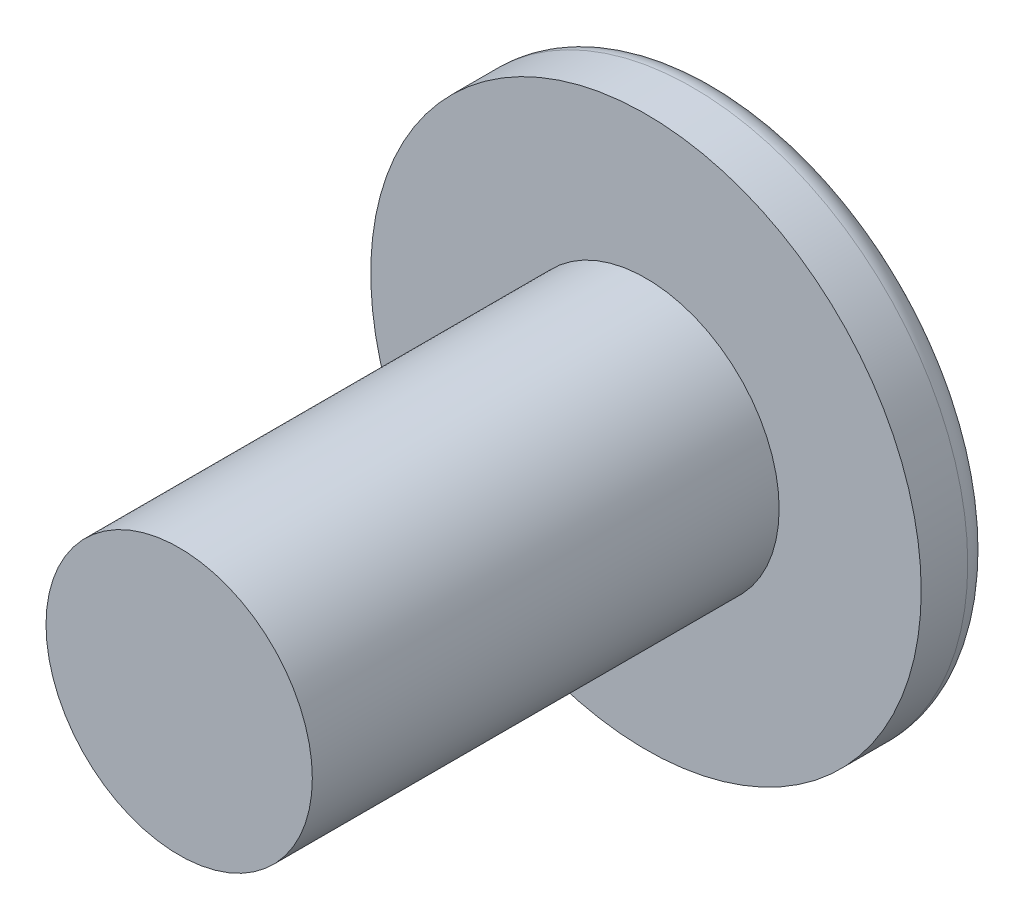
ISO-10303-21;
HEADER;
FILE_DESCRIPTION(('STEP AP214'),'2;1');
FILE_NAME('part.step','',(''),(''),'','','');
FILE_SCHEMA(('AUTOMOTIVE_DESIGN { 1 0 10303 214 1 1 1 1 }'));
ENDSEC;
DATA;
#1=APPLICATION_CONTEXT('core data for automotive mechanical design processes');
#2=APPLICATION_PROTOCOL_DEFINITION('international standard','automotive_design',2000,#1);
#3=PRODUCT_CONTEXT('',#1,'mechanical');
#4=PRODUCT('Part','Part','',(#3));
#5=PRODUCT_RELATED_PRODUCT_CATEGORY('part','',(#4));
#6=PRODUCT_DEFINITION_FORMATION('','',#4);
#7=PRODUCT_DEFINITION_CONTEXT('part definition',#1,'design');
#8=PRODUCT_DEFINITION('design','',#6,#7);
#9=PRODUCT_DEFINITION_SHAPE('','',#8);
#10=(LENGTH_UNIT() NAMED_UNIT(*) SI_UNIT(.MILLI.,.METRE.));
#11=(NAMED_UNIT(*) PLANE_ANGLE_UNIT() SI_UNIT($,.RADIAN.));
#12=(NAMED_UNIT(*) SI_UNIT($,.STERADIAN.) SOLID_ANGLE_UNIT());
#13=UNCERTAINTY_MEASURE_WITH_UNIT(LENGTH_MEASURE(1.E-05),#10,'distance_accuracy_value','');
#14=(GEOMETRIC_REPRESENTATION_CONTEXT(3) GLOBAL_UNCERTAINTY_ASSIGNED_CONTEXT((#13)) GLOBAL_UNIT_ASSIGNED_CONTEXT((#10,
#11,#12)) REPRESENTATION_CONTEXT('',''));
#15=CARTESIAN_POINT('',(0.,0.,0.));
#16=DIRECTION('',(0.,0.,1.));
#17=DIRECTION('',(1.,0.,0.));
#18=AXIS2_PLACEMENT_3D('',#15,#16,#17);
#19=CARTESIAN_POINT('',(0.,0.,1.44));
#20=DIRECTION('',(0.,0.,-1.));
#21=DIRECTION('',(-1.,0.,0.));
#22=AXIS2_PLACEMENT_3D('',#19,#20,#21);
#23=CYLINDRICAL_SURFACE('',#22,5.56);
#24=CARTESIAN_POINT('',(0.,0.,0.5));
#25=DIRECTION('',(0.,0.,1.));
#26=DIRECTION('',(1.,0.,0.));
#27=AXIS2_PLACEMENT_3D('',#24,#25,#26);
#28=CIRCLE('',#27,5.56);
#29=CARTESIAN_POINT('',(5.56,0.,0.5));
#30=VERTEX_POINT('',#29);
#31=EDGE_CURVE('E48',#30,#30,#28,.T.);
#32=ORIENTED_EDGE('',*,*,#31,.T.);
#33=EDGE_LOOP('',(#32));
#34=FACE_BOUND('',#33,.T.);
#35=CARTESIAN_POINT('',(0.,0.,1.44));
#36=DIRECTION('',(0.,0.,1.));
#37=DIRECTION('',(1.,0.,0.));
#38=AXIS2_PLACEMENT_3D('',#35,#36,#37);
#39=CIRCLE('',#38,5.56);
#40=CARTESIAN_POINT('',(5.56,0.,1.44));
#41=VERTEX_POINT('',#40);
#42=EDGE_CURVE('E60',#41,#41,#39,.T.);
#43=ORIENTED_EDGE('',*,*,#42,.F.);
#44=EDGE_LOOP('',(#43));
#45=FACE_BOUND('',#44,.T.);
#46=ADVANCED_FACE('F40',(#34,#45),#23,.T.);
#47=CARTESIAN_POINT('',(0.,0.,1.44));
#48=DIRECTION('',(0.,0.,1.));
#49=DIRECTION('',(1.,0.,0.));
#50=AXIS2_PLACEMENT_3D('',#47,#48,#49);
#51=PLANE('',#50);
#52=CARTESIAN_POINT('',(0.,0.,1.44));
#53=DIRECTION('',(0.,0.,1.));
#54=DIRECTION('',(1.,0.,0.));
#55=AXIS2_PLACEMENT_3D('',#52,#53,#54);
#56=CIRCLE('',#55,2.69);
#57=CARTESIAN_POINT('',(2.69,0.,1.44));
#58=VERTEX_POINT('',#57);
#59=EDGE_CURVE('E54',#58,#58,#56,.T.);
#60=ORIENTED_EDGE('',*,*,#59,.F.);
#61=EDGE_LOOP('',(#60));
#62=FACE_BOUND('',#61,.T.);
#63=ORIENTED_EDGE('',*,*,#42,.T.);
#64=EDGE_LOOP('',(#63));
#65=FACE_BOUND('',#64,.T.);
#66=ADVANCED_FACE('F84',(#62,#65),#51,.T.);
#67=CARTESIAN_POINT('',(0.,0.,0.));
#68=DIRECTION('',(0.,0.,1.));
#69=DIRECTION('',(1.,0.,0.));
#70=AXIS2_PLACEMENT_3D('',#67,#68,#69);
#71=PLANE('',#70);
#72=CARTESIAN_POINT('',(0.,0.,0.));
#73=DIRECTION('',(0.,0.,1.));
#74=DIRECTION('',(1.,0.,0.));
#75=AXIS2_PLACEMENT_3D('',#72,#73,#74);
#76=CIRCLE('',#75,5.06);
#77=CARTESIAN_POINT('',(5.06,0.,0.));
#78=VERTEX_POINT('',#77);
#79=EDGE_CURVE('E11',#78,#78,#76,.F.);
#80=ORIENTED_EDGE('',*,*,#79,.T.);
#81=EDGE_LOOP('',(#80));
#82=FACE_BOUND('',#81,.T.);
#83=ADVANCED_FACE('F76',(#82),#71,.F.);
#84=CARTESIAN_POINT('',(0.,0.,29.3484689655672));
#85=DIRECTION('',(0.,0.,-1.));
#86=DIRECTION('',(-1.,0.,0.));
#87=AXIS2_PLACEMENT_3D('',#84,#85,#86);
#88=CYLINDRICAL_SURFACE('',#87,2.69);
#89=ORIENTED_EDGE('',*,*,#59,.T.);
#90=EDGE_LOOP('',(#89));
#91=FACE_BOUND('',#90,.T.);
#92=CARTESIAN_POINT('',(0.,0.,10.87));
#93=DIRECTION('',(0.,0.,1.));
#94=DIRECTION('',(1.,0.,0.));
#95=AXIS2_PLACEMENT_3D('',#92,#93,#94);
#96=CIRCLE('',#95,2.69);
#97=CARTESIAN_POINT('',(2.69,0.,10.87));
#98=VERTEX_POINT('',#97);
#99=EDGE_CURVE('E66',#98,#98,#96,.T.);
#100=ORIENTED_EDGE('',*,*,#99,.F.);
#101=EDGE_LOOP('',(#100));
#102=FACE_BOUND('',#101,.T.);
#103=ADVANCED_FACE('F74',(#91,#102),#88,.T.);
#104=CARTESIAN_POINT('',(0.,0.,10.87));
#105=DIRECTION('',(0.,0.,1.));
#106=DIRECTION('',(1.,0.,0.));
#107=AXIS2_PLACEMENT_3D('',#104,#105,#106);
#108=PLANE('',#107);
#109=ORIENTED_EDGE('',*,*,#99,.T.);
#110=EDGE_LOOP('',(#109));
#111=FACE_BOUND('',#110,.T.);
#112=ADVANCED_FACE('F72',(#111),#108,.T.);
#113=CARTESIAN_POINT('',(0.,0.,0.5));
#114=DIRECTION('',(0.,0.,1.));
#115=DIRECTION('',(1.,0.,0.));
#116=AXIS2_PLACEMENT_3D('',#113,#114,#115);
#117=TOROIDAL_SURFACE('',#116,5.06,0.5);
#118=ORIENTED_EDGE('',*,*,#79,.F.);
#119=EDGE_LOOP('',(#118));
#120=FACE_BOUND('',#119,.T.);
#121=ORIENTED_EDGE('',*,*,#31,.F.);
#122=EDGE_LOOP('',(#121));
#123=FACE_BOUND('',#122,.T.);
#124=ADVANCED_FACE('F42',(#120,#123),#117,.T.);
#125=CLOSED_SHELL('',(#46,#66,#83,#103,#112,#124));
#126=MANIFOLD_SOLID_BREP('B2',#125);
#127=ADVANCED_BREP_SHAPE_REPRESENTATION('',(#18,#126),#14);
#128=SHAPE_DEFINITION_REPRESENTATION(#9,#127);
ENDSEC;
END-ISO-10303-21;
